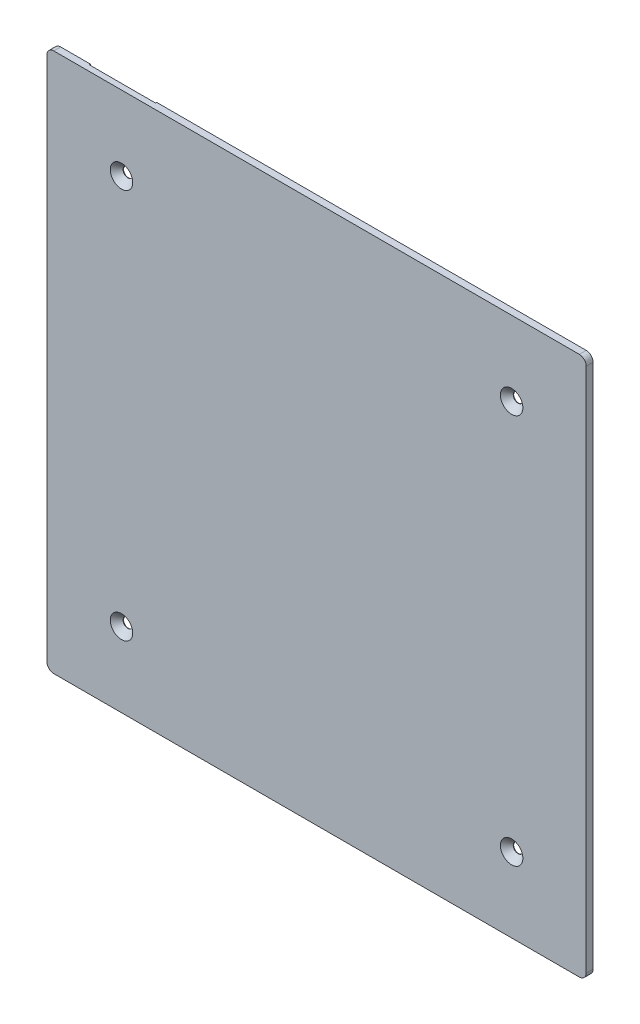
ISO-10303-21;
HEADER;
FILE_DESCRIPTION(('STEP AP214'),'2;1');
FILE_NAME('part.step','',(''),(''),'','','');
FILE_SCHEMA(('AUTOMOTIVE_DESIGN { 1 0 10303 214 1 1 1 1 }'));
ENDSEC;
DATA;
#1=APPLICATION_CONTEXT('core data for automotive mechanical design processes');
#2=APPLICATION_PROTOCOL_DEFINITION('international standard','automotive_design',2000,#1);
#3=PRODUCT_CONTEXT('',#1,'mechanical');
#4=PRODUCT('Part','Part','',(#3));
#5=PRODUCT_RELATED_PRODUCT_CATEGORY('part','',(#4));
#6=PRODUCT_DEFINITION_FORMATION('','',#4);
#7=PRODUCT_DEFINITION_CONTEXT('part definition',#1,'design');
#8=PRODUCT_DEFINITION('design','',#6,#7);
#9=PRODUCT_DEFINITION_SHAPE('','',#8);
#10=(LENGTH_UNIT() NAMED_UNIT(*) SI_UNIT(.MILLI.,.METRE.));
#11=(NAMED_UNIT(*) PLANE_ANGLE_UNIT() SI_UNIT($,.RADIAN.));
#12=(NAMED_UNIT(*) SI_UNIT($,.STERADIAN.) SOLID_ANGLE_UNIT());
#13=UNCERTAINTY_MEASURE_WITH_UNIT(LENGTH_MEASURE(1.E-05),#10,'distance_accuracy_value','');
#14=(GEOMETRIC_REPRESENTATION_CONTEXT(3) GLOBAL_UNCERTAINTY_ASSIGNED_CONTEXT((#13)) GLOBAL_UNIT_ASSIGNED_CONTEXT((#10,
#11,#12)) REPRESENTATION_CONTEXT('',''));
#15=CARTESIAN_POINT('',(0.,0.,0.));
#16=DIRECTION('',(0.,0.,1.));
#17=DIRECTION('',(1.,0.,0.));
#18=AXIS2_PLACEMENT_3D('',#15,#16,#17);
#19=CARTESIAN_POINT('',(-72.6507614869108,117.5,0.5));
#20=DIRECTION('',(1.,0.,0.));
#21=DIRECTION('',(0.,0.,-1.));
#22=AXIS2_PLACEMENT_3D('',#19,#20,#21);
#23=PLANE('',#22);
#24=DIRECTION('',(0.,0.,-1.));
#25=VECTOR('',#24,1.);
#26=CARTESIAN_POINT('',(-72.6507614869108,106.050790199477,0.5));
#27=LINE('',#26,#25);
#28=CARTESIAN_POINT('',(-72.6507614869108,106.050790199477,0.));
#29=VERTEX_POINT('',#28);
#30=CARTESIAN_POINT('',(-72.6507614869108,106.050790199477,0.5));
#31=VERTEX_POINT('',#30);
#32=EDGE_CURVE('E171',#29,#31,#27,.F.);
#33=ORIENTED_EDGE('',*,*,#32,.T.);
#34=DIRECTION('',(0.,1.,0.));
#35=VECTOR('',#34,1.);
#36=CARTESIAN_POINT('',(-72.6507614869108,0.,0.5));
#37=LINE('',#36,#35);
#38=CARTESIAN_POINT('',(-72.6507614869108,117.5,0.5));
#39=VERTEX_POINT('',#38);
#40=EDGE_CURVE('E118',#39,#31,#37,.F.);
#41=ORIENTED_EDGE('',*,*,#40,.F.);
#42=DIRECTION('',(0.,0.,-1.));
#43=VECTOR('',#42,1.);
#44=CARTESIAN_POINT('',(-72.6507614869108,117.5,0.5));
#45=LINE('',#44,#43);
#46=CARTESIAN_POINT('',(-72.6507614869108,117.5,0.));
#47=VERTEX_POINT('',#46);
#48=EDGE_CURVE('E114',#47,#39,#45,.F.);
#49=ORIENTED_EDGE('',*,*,#48,.F.);
#50=DIRECTION('',(0.,1.,0.));
#51=VECTOR('',#50,1.);
#52=CARTESIAN_POINT('',(-72.6507614869108,0.,0.));
#53=LINE('',#52,#51);
#54=EDGE_CURVE('E117',#29,#47,#53,.T.);
#55=ORIENTED_EDGE('',*,*,#54,.F.);
#56=EDGE_LOOP('',(#33,#41,#49,#55));
#57=FACE_BOUND('',#56,.T.);
#58=ADVANCED_FACE('F18',(#57),#23,.F.);
#59=CARTESIAN_POINT('',(-101.46292574176,117.5,0.5));
#60=DIRECTION('',(-1.,0.,0.));
#61=DIRECTION('',(0.,0.,1.));
#62=AXIS2_PLACEMENT_3D('',#59,#60,#61);
#63=PLANE('',#62);
#64=DIRECTION('',(0.,0.,1.));
#65=VECTOR('',#64,1.);
#66=CARTESIAN_POINT('',(-101.46292574176,117.5,0.5));
#67=LINE('',#66,#65);
#68=CARTESIAN_POINT('',(-101.46292574176,117.5,0.5));
#69=VERTEX_POINT('',#68);
#70=CARTESIAN_POINT('',(-101.46292574176,117.5,0.));
#71=VERTEX_POINT('',#70);
#72=EDGE_CURVE('E123',#69,#71,#67,.F.);
#73=ORIENTED_EDGE('',*,*,#72,.F.);
#74=DIRECTION('',(0.,1.,0.));
#75=VECTOR('',#74,1.);
#76=CARTESIAN_POINT('',(-101.46292574176,0.,0.5));
#77=LINE('',#76,#75);
#78=CARTESIAN_POINT('',(-101.46292574176,106.050790199477,0.5));
#79=VERTEX_POINT('',#78);
#80=EDGE_CURVE('E131',#79,#69,#77,.T.);
#81=ORIENTED_EDGE('',*,*,#80,.F.);
#82=DIRECTION('',(0.,0.,-1.));
#83=VECTOR('',#82,1.);
#84=CARTESIAN_POINT('',(-101.46292574176,106.050790199477,0.5));
#85=LINE('',#84,#83);
#86=CARTESIAN_POINT('',(-101.46292574176,106.050790199477,0.));
#87=VERTEX_POINT('',#86);
#88=EDGE_CURVE('E174',#79,#87,#85,.T.);
#89=ORIENTED_EDGE('',*,*,#88,.T.);
#90=DIRECTION('',(0.,1.,0.));
#91=VECTOR('',#90,1.);
#92=CARTESIAN_POINT('',(-101.46292574176,0.,0.));
#93=LINE('',#92,#91);
#94=EDGE_CURVE('E95',#71,#87,#93,.F.);
#95=ORIENTED_EDGE('',*,*,#94,.F.);
#96=EDGE_LOOP('',(#73,#81,#89,#95));
#97=FACE_BOUND('',#96,.T.);
#98=ADVANCED_FACE('F338',(#97),#63,.F.);
#99=CARTESIAN_POINT('',(-72.6507614869108,106.050790199477,0.5));
#100=DIRECTION('',(0.,-1.,0.));
#101=DIRECTION('',(0.,0.,-1.));
#102=AXIS2_PLACEMENT_3D('',#99,#100,#101);
#103=PLANE('',#102);
#104=ORIENTED_EDGE('',*,*,#88,.F.);
#105=DIRECTION('',(-1.,0.,0.));
#106=VECTOR('',#105,1.);
#107=CARTESIAN_POINT('',(0.,106.050790199477,0.5));
#108=LINE('',#107,#106);
#109=EDGE_CURVE('E186',#31,#79,#108,.T.);
#110=ORIENTED_EDGE('',*,*,#109,.F.);
#111=ORIENTED_EDGE('',*,*,#32,.F.);
#112=DIRECTION('',(-1.,0.,0.));
#113=VECTOR('',#112,1.);
#114=CARTESIAN_POINT('',(0.,106.050790199477,0.));
#115=LINE('',#114,#113);
#116=EDGE_CURVE('E130',#87,#29,#115,.F.);
#117=ORIENTED_EDGE('',*,*,#116,.F.);
#118=EDGE_LOOP('',(#104,#110,#111,#117));
#119=FACE_BOUND('',#118,.T.);
#120=ADVANCED_FACE('F251',(#119),#103,.F.);
#121=CARTESIAN_POINT('',(-85.,-85.,3.));
#122=DIRECTION('',(0.,0.,-1.));
#123=DIRECTION('',(-1.,0.,0.));
#124=AXIS2_PLACEMENT_3D('',#121,#122,#123);
#125=CYLINDRICAL_SURFACE('',#124,2.1);
#126=CARTESIAN_POINT('',(-85.,-85.,0.));
#127=DIRECTION('',(0.,0.,-1.));
#128=DIRECTION('',(-1.,0.,0.));
#129=AXIS2_PLACEMENT_3D('',#126,#127,#128);
#130=CIRCLE('',#129,2.1);
#131=CARTESIAN_POINT('',(-87.1,-85.,0.));
#132=VERTEX_POINT('',#131);
#133=EDGE_CURVE('E21',#132,#132,#130,.F.);
#134=ORIENTED_EDGE('',*,*,#133,.F.);
#135=EDGE_LOOP('',(#134));
#136=FACE_BOUND('',#135,.T.);
#137=CARTESIAN_POINT('',(-85.,-85.,0.200000000006639));
#138=DIRECTION('',(0.,0.,1.));
#139=DIRECTION('',(1.,0.,0.));
#140=AXIS2_PLACEMENT_3D('',#137,#138,#139);
#141=CIRCLE('',#140,2.09999999994806);
#142=CARTESIAN_POINT('',(-82.9000000000519,-85.,0.200000000006639));
#143=VERTEX_POINT('',#142);
#144=EDGE_CURVE('E166',#143,#143,#141,.T.);
#145=ORIENTED_EDGE('',*,*,#144,.T.);
#146=EDGE_LOOP('',(#145));
#147=FACE_BOUND('',#146,.T.);
#148=ADVANCED_FACE('F247',(#136,#147),#125,.F.);
#149=CARTESIAN_POINT('',(85.,-85.,3.));
#150=DIRECTION('',(0.,0.,-1.));
#151=DIRECTION('',(-1.,0.,0.));
#152=AXIS2_PLACEMENT_3D('',#149,#150,#151);
#153=CYLINDRICAL_SURFACE('',#152,2.1);
#154=CARTESIAN_POINT('',(85.,-85.,0.));
#155=DIRECTION('',(0.,0.,-1.));
#156=DIRECTION('',(-1.,0.,0.));
#157=AXIS2_PLACEMENT_3D('',#154,#155,#156);
#158=CIRCLE('',#157,2.1);
#159=CARTESIAN_POINT('',(82.9,-85.,0.));
#160=VERTEX_POINT('',#159);
#161=EDGE_CURVE('E169',#160,#160,#158,.F.);
#162=ORIENTED_EDGE('',*,*,#161,.F.);
#163=EDGE_LOOP('',(#162));
#164=FACE_BOUND('',#163,.T.);
#165=CARTESIAN_POINT('',(85.,-85.,0.200000000006639));
#166=DIRECTION('',(0.,0.,1.));
#167=DIRECTION('',(1.,0.,0.));
#168=AXIS2_PLACEMENT_3D('',#165,#166,#167);
#169=CIRCLE('',#168,2.09999999996396);
#170=CARTESIAN_POINT('',(87.099999999964,-85.,0.200000000006639));
#171=VERTEX_POINT('',#170);
#172=EDGE_CURVE('E163',#171,#171,#169,.T.);
#173=ORIENTED_EDGE('',*,*,#172,.T.);
#174=EDGE_LOOP('',(#173));
#175=FACE_BOUND('',#174,.T.);
#176=ADVANCED_FACE('F250',(#164,#175),#153,.F.);
#177=CARTESIAN_POINT('',(85.,85.,3.));
#178=DIRECTION('',(0.,0.,-1.));
#179=DIRECTION('',(-1.,0.,0.));
#180=AXIS2_PLACEMENT_3D('',#177,#178,#179);
#181=CYLINDRICAL_SURFACE('',#180,2.1);
#182=CARTESIAN_POINT('',(85.,85.,0.));
#183=DIRECTION('',(0.,0.,-1.));
#184=DIRECTION('',(-1.,0.,0.));
#185=AXIS2_PLACEMENT_3D('',#182,#183,#184);
#186=CIRCLE('',#185,2.1);
#187=CARTESIAN_POINT('',(82.9,85.,0.));
#188=VERTEX_POINT('',#187);
#189=EDGE_CURVE('E237',#188,#188,#186,.F.);
#190=ORIENTED_EDGE('',*,*,#189,.F.);
#191=EDGE_LOOP('',(#190));
#192=FACE_BOUND('',#191,.T.);
#193=CARTESIAN_POINT('',(85.,85.,0.200000000006639));
#194=DIRECTION('',(0.,0.,1.));
#195=DIRECTION('',(1.,0.,0.));
#196=AXIS2_PLACEMENT_3D('',#193,#194,#195);
#197=CIRCLE('',#196,2.09999999996396);
#198=CARTESIAN_POINT('',(87.099999999964,85.,0.200000000006639));
#199=VERTEX_POINT('',#198);
#200=EDGE_CURVE('E160',#199,#199,#197,.T.);
#201=ORIENTED_EDGE('',*,*,#200,.T.);
#202=EDGE_LOOP('',(#201));
#203=FACE_BOUND('',#202,.T.);
#204=ADVANCED_FACE('F321',(#192,#203),#181,.F.);
#205=CARTESIAN_POINT('',(-85.,85.,3.));
#206=DIRECTION('',(0.,0.,-1.));
#207=DIRECTION('',(-1.,0.,0.));
#208=AXIS2_PLACEMENT_3D('',#205,#206,#207);
#209=CYLINDRICAL_SURFACE('',#208,2.1);
#210=CARTESIAN_POINT('',(-85.,85.,0.));
#211=DIRECTION('',(0.,0.,-1.));
#212=DIRECTION('',(-1.,0.,0.));
#213=AXIS2_PLACEMENT_3D('',#210,#211,#212);
#214=CIRCLE('',#213,2.1);
#215=CARTESIAN_POINT('',(-87.1,85.,0.));
#216=VERTEX_POINT('',#215);
#217=EDGE_CURVE('E239',#216,#216,#214,.F.);
#218=ORIENTED_EDGE('',*,*,#217,.F.);
#219=EDGE_LOOP('',(#218));
#220=FACE_BOUND('',#219,.T.);
#221=CARTESIAN_POINT('',(-85.,85.,0.200000000006639));
#222=DIRECTION('',(0.,0.,1.));
#223=DIRECTION('',(1.,0.,0.));
#224=AXIS2_PLACEMENT_3D('',#221,#222,#223);
#225=CIRCLE('',#224,2.09999999994806);
#226=CARTESIAN_POINT('',(-82.9000000000519,85.,0.200000000006639));
#227=VERTEX_POINT('',#226);
#228=EDGE_CURVE('E157',#227,#227,#225,.T.);
#229=ORIENTED_EDGE('',*,*,#228,.T.);
#230=EDGE_LOOP('',(#229));
#231=FACE_BOUND('',#230,.T.);
#232=ADVANCED_FACE('F323',(#220,#231),#209,.F.);
#233=CARTESIAN_POINT('',(0.,0.,0.5));
#234=DIRECTION('',(0.,0.,-1.));
#235=DIRECTION('',(-1.,0.,0.));
#236=AXIS2_PLACEMENT_3D('',#233,#234,#235);
#237=PLANE('',#236);
#238=ORIENTED_EDGE('',*,*,#80,.T.);
#239=DIRECTION('',(1.,0.,0.));
#240=VECTOR('',#239,1.);
#241=CARTESIAN_POINT('',(-117.5,117.5,0.5));
#242=LINE('',#241,#240);
#243=EDGE_CURVE('E137',#69,#39,#242,.T.);
#244=ORIENTED_EDGE('',*,*,#243,.T.);
#245=ORIENTED_EDGE('',*,*,#40,.T.);
#246=ORIENTED_EDGE('',*,*,#109,.T.);
#247=EDGE_LOOP('',(#238,#244,#245,#246));
#248=FACE_BOUND('',#247,.T.);
#249=ADVANCED_FACE('F268',(#248),#237,.T.);
#250=CARTESIAN_POINT('',(0.,0.,0.));
#251=DIRECTION('',(0.,0.,-1.));
#252=DIRECTION('',(-1.,0.,0.));
#253=AXIS2_PLACEMENT_3D('',#250,#251,#252);
#254=PLANE('',#253);
#255=ORIENTED_EDGE('',*,*,#161,.T.);
#256=EDGE_LOOP('',(#255));
#257=FACE_BOUND('',#256,.T.);
#258=ORIENTED_EDGE('',*,*,#189,.T.);
#259=EDGE_LOOP('',(#258));
#260=FACE_BOUND('',#259,.T.);
#261=ORIENTED_EDGE('',*,*,#217,.T.);
#262=EDGE_LOOP('',(#261));
#263=FACE_BOUND('',#262,.T.);
#264=ORIENTED_EDGE('',*,*,#133,.T.);
#265=EDGE_LOOP('',(#264));
#266=FACE_BOUND('',#265,.T.);
#267=ORIENTED_EDGE('',*,*,#94,.T.);
#268=ORIENTED_EDGE('',*,*,#116,.T.);
#269=ORIENTED_EDGE('',*,*,#54,.T.);
#270=DIRECTION('',(1.,0.,0.));
#271=VECTOR('',#270,1.);
#272=CARTESIAN_POINT('',(-117.5,117.5,0.));
#273=LINE('',#272,#271);
#274=CARTESIAN_POINT('',(114.5,117.5,0.));
#275=VERTEX_POINT('',#274);
#276=EDGE_CURVE('E127',#47,#275,#273,.T.);
#277=ORIENTED_EDGE('',*,*,#276,.T.);
#278=CARTESIAN_POINT('',(114.5,114.5,0.));
#279=DIRECTION('',(0.,0.,-1.));
#280=DIRECTION('',(-1.,0.,0.));
#281=AXIS2_PLACEMENT_3D('',#278,#279,#280);
#282=CIRCLE('',#281,3.);
#283=CARTESIAN_POINT('',(117.5,114.5,0.));
#284=VERTEX_POINT('',#283);
#285=EDGE_CURVE('E136',#284,#275,#282,.F.);
#286=ORIENTED_EDGE('',*,*,#285,.F.);
#287=DIRECTION('',(0.,1.,0.));
#288=VECTOR('',#287,1.);
#289=CARTESIAN_POINT('',(117.5,-117.5,0.));
#290=LINE('',#289,#288);
#291=CARTESIAN_POINT('',(117.5,-114.5,0.));
#292=VERTEX_POINT('',#291);
#293=EDGE_CURVE('E144',#284,#292,#290,.F.);
#294=ORIENTED_EDGE('',*,*,#293,.T.);
#295=CARTESIAN_POINT('',(114.5,-114.5,0.));
#296=DIRECTION('',(0.,0.,-1.));
#297=DIRECTION('',(-1.,0.,0.));
#298=AXIS2_PLACEMENT_3D('',#295,#296,#297);
#299=CIRCLE('',#298,3.);
#300=CARTESIAN_POINT('',(114.5,-117.5,0.));
#301=VERTEX_POINT('',#300);
#302=EDGE_CURVE('E231',#301,#292,#299,.F.);
#303=ORIENTED_EDGE('',*,*,#302,.F.);
#304=DIRECTION('',(1.,0.,0.));
#305=VECTOR('',#304,1.);
#306=CARTESIAN_POINT('',(-117.5,-117.5,0.));
#307=LINE('',#306,#305);
#308=CARTESIAN_POINT('',(-114.5,-117.5,0.));
#309=VERTEX_POINT('',#308);
#310=EDGE_CURVE('E230',#301,#309,#307,.F.);
#311=ORIENTED_EDGE('',*,*,#310,.T.);
#312=CARTESIAN_POINT('',(-114.5,-114.5,0.));
#313=DIRECTION('',(0.,0.,-1.));
#314=DIRECTION('',(-1.,0.,0.));
#315=AXIS2_PLACEMENT_3D('',#312,#313,#314);
#316=CIRCLE('',#315,3.);
#317=CARTESIAN_POINT('',(-117.5,-114.5,0.));
#318=VERTEX_POINT('',#317);
#319=EDGE_CURVE('E227',#318,#309,#316,.F.);
#320=ORIENTED_EDGE('',*,*,#319,.F.);
#321=DIRECTION('',(0.,1.,0.));
#322=VECTOR('',#321,1.);
#323=CARTESIAN_POINT('',(-117.5,-117.5,0.));
#324=LINE('',#323,#322);
#325=CARTESIAN_POINT('',(-117.5,114.5,0.));
#326=VERTEX_POINT('',#325);
#327=EDGE_CURVE('E226',#318,#326,#324,.T.);
#328=ORIENTED_EDGE('',*,*,#327,.T.);
#329=CARTESIAN_POINT('',(-114.5,114.5,0.));
#330=DIRECTION('',(0.,0.,-1.));
#331=DIRECTION('',(-1.,0.,0.));
#332=AXIS2_PLACEMENT_3D('',#329,#330,#331);
#333=CIRCLE('',#332,3.);
#334=CARTESIAN_POINT('',(-114.5,117.5,0.));
#335=VERTEX_POINT('',#334);
#336=EDGE_CURVE('E85',#335,#326,#333,.F.);
#337=ORIENTED_EDGE('',*,*,#336,.F.);
#338=DIRECTION('',(1.,0.,0.));
#339=VECTOR('',#338,1.);
#340=CARTESIAN_POINT('',(-117.5,117.5,0.));
#341=LINE('',#340,#339);
#342=EDGE_CURVE('E140',#335,#71,#341,.T.);
#343=ORIENTED_EDGE('',*,*,#342,.T.);
#344=EDGE_LOOP('',(#267,#268,#269,#277,#286,#294,#303,#311,#320,#328,#337,#343));
#345=FACE_BOUND('',#344,.T.);
#346=ADVANCED_FACE('F126',(#257,#260,#263,#266,#345),#254,.T.);
#347=CARTESIAN_POINT('',(-85.,-85.,2.9999999999859));
#348=DIRECTION('',(0.,0.,1.));
#349=DIRECTION('',(1.,0.,0.));
#350=AXIS2_PLACEMENT_3D('',#347,#348,#349);
#351=CONICAL_SURFACE('',#350,4.89999999998417,0.785398163407599);
#352=CARTESIAN_POINT('',(-85.,-85.,3.00000000002229));
#353=DIRECTION('',(0.,0.,1.));
#354=DIRECTION('',(1.,0.,0.));
#355=AXIS2_PLACEMENT_3D('',#352,#353,#354);
#356=CIRCLE('',#355,4.90000000002055);
#357=CARTESIAN_POINT('',(-80.0999999999794,-85.,3.00000000002229));
#358=VERTEX_POINT('',#357);
#359=EDGE_CURVE('E223',#358,#358,#356,.T.);
#360=ORIENTED_EDGE('',*,*,#359,.T.);
#361=EDGE_LOOP('',(#360));
#362=FACE_BOUND('',#361,.T.);
#363=ORIENTED_EDGE('',*,*,#144,.F.);
#364=EDGE_LOOP('',(#363));
#365=FACE_BOUND('',#364,.T.);
#366=ADVANCED_FACE('F255',(#362,#365),#351,.F.);
#367=CARTESIAN_POINT('',(85.,-85.,2.99999999987222));
#368=DIRECTION('',(0.,0.,1.));
#369=DIRECTION('',(0.,-1.,0.));
#370=AXIS2_PLACEMENT_3D('',#367,#368,#369);
#371=CONICAL_SURFACE('',#370,4.89999999988638,0.785398163397448);
#372=CARTESIAN_POINT('',(85.,-85.,2.9999999999859));
#373=DIRECTION('',(0.,0.,1.));
#374=DIRECTION('',(0.,-1.,0.));
#375=AXIS2_PLACEMENT_3D('',#372,#373,#374);
#376=CIRCLE('',#375,4.90000000000007);
#377=CARTESIAN_POINT('',(85.,-89.9000000000001,2.9999999999859));
#378=VERTEX_POINT('',#377);
#379=EDGE_CURVE('E220',#378,#378,#376,.T.);
#380=ORIENTED_EDGE('',*,*,#379,.T.);
#381=EDGE_LOOP('',(#380));
#382=FACE_BOUND('',#381,.T.);
#383=ORIENTED_EDGE('',*,*,#172,.F.);
#384=EDGE_LOOP('',(#383));
#385=FACE_BOUND('',#384,.T.);
#386=ADVANCED_FACE('F257',(#382,#385),#371,.F.);
#387=CARTESIAN_POINT('',(85.,85.,2.99999999987222));
#388=DIRECTION('',(0.,0.,1.));
#389=DIRECTION('',(0.,-1.,0.));
#390=AXIS2_PLACEMENT_3D('',#387,#388,#389);
#391=CONICAL_SURFACE('',#390,4.89999999988638,0.785398163397448);
#392=CARTESIAN_POINT('',(85.,85.,2.9999999999859));
#393=DIRECTION('',(0.,0.,1.));
#394=DIRECTION('',(0.,-1.,0.));
#395=AXIS2_PLACEMENT_3D('',#392,#393,#394);
#396=CIRCLE('',#395,4.90000000000007);
#397=CARTESIAN_POINT('',(85.,80.1,2.9999999999859));
#398=VERTEX_POINT('',#397);
#399=EDGE_CURVE('E217',#398,#398,#396,.T.);
#400=ORIENTED_EDGE('',*,*,#399,.T.);
#401=EDGE_LOOP('',(#400));
#402=FACE_BOUND('',#401,.T.);
#403=ORIENTED_EDGE('',*,*,#200,.F.);
#404=EDGE_LOOP('',(#403));
#405=FACE_BOUND('',#404,.T.);
#406=ADVANCED_FACE('F265',(#402,#405),#391,.F.);
#407=CARTESIAN_POINT('',(-85.,85.,2.9999999999859));
#408=DIRECTION('',(0.,0.,1.));
#409=DIRECTION('',(1.,0.,0.));
#410=AXIS2_PLACEMENT_3D('',#407,#408,#409);
#411=CONICAL_SURFACE('',#410,4.89999999998417,0.785398163407599);
#412=CARTESIAN_POINT('',(-85.,85.,3.00000000002229));
#413=DIRECTION('',(0.,0.,1.));
#414=DIRECTION('',(1.,0.,0.));
#415=AXIS2_PLACEMENT_3D('',#412,#413,#414);
#416=CIRCLE('',#415,4.90000000002055);
#417=CARTESIAN_POINT('',(-80.0999999999794,85.,3.00000000002229));
#418=VERTEX_POINT('',#417);
#419=EDGE_CURVE('E214',#418,#418,#416,.T.);
#420=ORIENTED_EDGE('',*,*,#419,.T.);
#421=EDGE_LOOP('',(#420));
#422=FACE_BOUND('',#421,.T.);
#423=ORIENTED_EDGE('',*,*,#228,.F.);
#424=EDGE_LOOP('',(#423));
#425=FACE_BOUND('',#424,.T.);
#426=ADVANCED_FACE('F308',(#422,#425),#411,.F.);
#427=CARTESIAN_POINT('',(-114.5,114.5,3.));
#428=DIRECTION('',(0.,0.,-1.));
#429=DIRECTION('',(-1.,0.,0.));
#430=AXIS2_PLACEMENT_3D('',#427,#428,#429);
#431=CYLINDRICAL_SURFACE('',#430,3.);
#432=ORIENTED_EDGE('',*,*,#336,.T.);
#433=DIRECTION('',(0.,0.,-1.));
#434=VECTOR('',#433,1.);
#435=CARTESIAN_POINT('',(-117.5,114.5,3.));
#436=LINE('',#435,#434);
#437=CARTESIAN_POINT('',(-117.5,114.5,3.));
#438=VERTEX_POINT('',#437);
#439=EDGE_CURVE('E509',#326,#438,#436,.F.);
#440=ORIENTED_EDGE('',*,*,#439,.T.);
#441=CARTESIAN_POINT('',(-114.5,114.5,3.));
#442=DIRECTION('',(0.,0.,-1.));
#443=DIRECTION('',(-1.,0.,0.));
#444=AXIS2_PLACEMENT_3D('',#441,#442,#443);
#445=CIRCLE('',#444,3.);
#446=CARTESIAN_POINT('',(-114.5,117.5,3.));
#447=VERTEX_POINT('',#446);
#448=EDGE_CURVE('E211',#438,#447,#445,.T.);
#449=ORIENTED_EDGE('',*,*,#448,.T.);
#450=DIRECTION('',(0.,0.,-1.));
#451=VECTOR('',#450,1.);
#452=CARTESIAN_POINT('',(-114.5,117.5,3.));
#453=LINE('',#452,#451);
#454=EDGE_CURVE('E151',#447,#335,#453,.T.);
#455=ORIENTED_EDGE('',*,*,#454,.T.);
#456=EDGE_LOOP('',(#432,#440,#449,#455));
#457=FACE_BOUND('',#456,.T.);
#458=ADVANCED_FACE('F305',(#457),#431,.T.);
#459=CARTESIAN_POINT('',(-117.5,117.5,3.));
#460=DIRECTION('',(0.,-1.,0.));
#461=DIRECTION('',(0.,0.,-1.));
#462=AXIS2_PLACEMENT_3D('',#459,#460,#461);
#463=PLANE('',#462);
#464=ORIENTED_EDGE('',*,*,#48,.T.);
#465=ORIENTED_EDGE('',*,*,#243,.F.);
#466=ORIENTED_EDGE('',*,*,#72,.T.);
#467=ORIENTED_EDGE('',*,*,#342,.F.);
#468=ORIENTED_EDGE('',*,*,#454,.F.);
#469=DIRECTION('',(-1.,0.,0.));
#470=VECTOR('',#469,1.);
#471=CARTESIAN_POINT('',(0.,117.5,3.));
#472=LINE('',#471,#470);
#473=CARTESIAN_POINT('',(114.5,117.5,3.));
#474=VERTEX_POINT('',#473);
#475=EDGE_CURVE('E210',#447,#474,#472,.F.);
#476=ORIENTED_EDGE('',*,*,#475,.T.);
#477=DIRECTION('',(0.,0.,-1.));
#478=VECTOR('',#477,1.);
#479=CARTESIAN_POINT('',(114.5,117.5,3.));
#480=LINE('',#479,#478);
#481=EDGE_CURVE('E135',#275,#474,#480,.F.);
#482=ORIENTED_EDGE('',*,*,#481,.F.);
#483=ORIENTED_EDGE('',*,*,#276,.F.);
#484=EDGE_LOOP('',(#464,#465,#466,#467,#468,#476,#482,#483));
#485=FACE_BOUND('',#484,.T.);
#486=ADVANCED_FACE('F133',(#485),#463,.F.);
#487=CARTESIAN_POINT('',(114.5,114.5,3.));
#488=DIRECTION('',(0.,0.,-1.));
#489=DIRECTION('',(-1.,0.,0.));
#490=AXIS2_PLACEMENT_3D('',#487,#488,#489);
#491=CYLINDRICAL_SURFACE('',#490,3.);
#492=ORIENTED_EDGE('',*,*,#285,.T.);
#493=ORIENTED_EDGE('',*,*,#481,.T.);
#494=CARTESIAN_POINT('',(114.5,114.5,3.));
#495=DIRECTION('',(0.,0.,-1.));
#496=DIRECTION('',(-1.,0.,0.));
#497=AXIS2_PLACEMENT_3D('',#494,#495,#496);
#498=CIRCLE('',#497,3.);
#499=CARTESIAN_POINT('',(117.5,114.5,3.));
#500=VERTEX_POINT('',#499);
#501=EDGE_CURVE('E207',#474,#500,#498,.T.);
#502=ORIENTED_EDGE('',*,*,#501,.T.);
#503=DIRECTION('',(0.,0.,1.));
#504=VECTOR('',#503,1.);
#505=CARTESIAN_POINT('',(117.5,114.5,3.));
#506=LINE('',#505,#504);
#507=EDGE_CURVE('E498',#500,#284,#506,.F.);
#508=ORIENTED_EDGE('',*,*,#507,.T.);
#509=EDGE_LOOP('',(#492,#493,#502,#508));
#510=FACE_BOUND('',#509,.T.);
#511=ADVANCED_FACE('F298',(#510),#491,.T.);
#512=CARTESIAN_POINT('',(117.5,-117.5,3.));
#513=DIRECTION('',(-1.,0.,0.));
#514=DIRECTION('',(0.,0.,1.));
#515=AXIS2_PLACEMENT_3D('',#512,#513,#514);
#516=PLANE('',#515);
#517=DIRECTION('',(0.,0.,-1.));
#518=VECTOR('',#517,1.);
#519=CARTESIAN_POINT('',(117.5,-114.5,3.));
#520=LINE('',#519,#518);
#521=CARTESIAN_POINT('',(117.5,-114.5,3.));
#522=VERTEX_POINT('',#521);
#523=EDGE_CURVE('E232',#292,#522,#520,.F.);
#524=ORIENTED_EDGE('',*,*,#523,.F.);
#525=ORIENTED_EDGE('',*,*,#293,.F.);
#526=ORIENTED_EDGE('',*,*,#507,.F.);
#527=DIRECTION('',(0.,1.,0.));
#528=VECTOR('',#527,1.);
#529=CARTESIAN_POINT('',(117.5,0.,3.));
#530=LINE('',#529,#528);
#531=EDGE_CURVE('E206',#500,#522,#530,.F.);
#532=ORIENTED_EDGE('',*,*,#531,.T.);
#533=EDGE_LOOP('',(#524,#525,#526,#532));
#534=FACE_BOUND('',#533,.T.);
#535=ADVANCED_FACE('F294',(#534),#516,.F.);
#536=CARTESIAN_POINT('',(114.5,-114.5,3.));
#537=DIRECTION('',(0.,0.,-1.));
#538=DIRECTION('',(-1.,0.,0.));
#539=AXIS2_PLACEMENT_3D('',#536,#537,#538);
#540=CYLINDRICAL_SURFACE('',#539,3.);
#541=ORIENTED_EDGE('',*,*,#302,.T.);
#542=ORIENTED_EDGE('',*,*,#523,.T.);
#543=CARTESIAN_POINT('',(114.5,-114.5,3.));
#544=DIRECTION('',(0.,0.,-1.));
#545=DIRECTION('',(-1.,0.,0.));
#546=AXIS2_PLACEMENT_3D('',#543,#544,#545);
#547=CIRCLE('',#546,3.);
#548=CARTESIAN_POINT('',(114.5,-117.5,3.));
#549=VERTEX_POINT('',#548);
#550=EDGE_CURVE('E203',#522,#549,#547,.T.);
#551=ORIENTED_EDGE('',*,*,#550,.T.);
#552=DIRECTION('',(0.,0.,1.));
#553=VECTOR('',#552,1.);
#554=CARTESIAN_POINT('',(114.5,-117.5,3.));
#555=LINE('',#554,#553);
#556=EDGE_CURVE('E490',#549,#301,#555,.F.);
#557=ORIENTED_EDGE('',*,*,#556,.T.);
#558=EDGE_LOOP('',(#541,#542,#551,#557));
#559=FACE_BOUND('',#558,.T.);
#560=ADVANCED_FACE('F290',(#559),#540,.T.);
#561=CARTESIAN_POINT('',(-117.5,-117.5,3.));
#562=DIRECTION('',(0.,1.,0.));
#563=DIRECTION('',(0.,0.,1.));
#564=AXIS2_PLACEMENT_3D('',#561,#562,#563);
#565=PLANE('',#564);
#566=DIRECTION('',(0.,0.,-1.));
#567=VECTOR('',#566,1.);
#568=CARTESIAN_POINT('',(-114.5,-117.5,3.));
#569=LINE('',#568,#567);
#570=CARTESIAN_POINT('',(-114.5,-117.5,3.));
#571=VERTEX_POINT('',#570);
#572=EDGE_CURVE('E229',#309,#571,#569,.F.);
#573=ORIENTED_EDGE('',*,*,#572,.F.);
#574=ORIENTED_EDGE('',*,*,#310,.F.);
#575=ORIENTED_EDGE('',*,*,#556,.F.);
#576=DIRECTION('',(-1.,0.,0.));
#577=VECTOR('',#576,1.);
#578=CARTESIAN_POINT('',(0.,-117.5,3.));
#579=LINE('',#578,#577);
#580=EDGE_CURVE('E202',#549,#571,#579,.T.);
#581=ORIENTED_EDGE('',*,*,#580,.T.);
#582=EDGE_LOOP('',(#573,#574,#575,#581));
#583=FACE_BOUND('',#582,.T.);
#584=ADVANCED_FACE('F286',(#583),#565,.F.);
#585=CARTESIAN_POINT('',(-114.5,-114.5,3.));
#586=DIRECTION('',(0.,0.,-1.));
#587=DIRECTION('',(-1.,0.,0.));
#588=AXIS2_PLACEMENT_3D('',#585,#586,#587);
#589=CYLINDRICAL_SURFACE('',#588,3.);
#590=ORIENTED_EDGE('',*,*,#319,.T.);
#591=ORIENTED_EDGE('',*,*,#572,.T.);
#592=CARTESIAN_POINT('',(-114.5,-114.5,3.));
#593=DIRECTION('',(0.,0.,-1.));
#594=DIRECTION('',(-1.,0.,0.));
#595=AXIS2_PLACEMENT_3D('',#592,#593,#594);
#596=CIRCLE('',#595,3.);
#597=CARTESIAN_POINT('',(-117.5,-114.5,3.));
#598=VERTEX_POINT('',#597);
#599=EDGE_CURVE('E27',#571,#598,#596,.T.);
#600=ORIENTED_EDGE('',*,*,#599,.T.);
#601=DIRECTION('',(0.,0.,-1.));
#602=VECTOR('',#601,1.);
#603=CARTESIAN_POINT('',(-117.5,-114.5,3.));
#604=LINE('',#603,#602);
#605=EDGE_CURVE('E35',#598,#318,#604,.T.);
#606=ORIENTED_EDGE('',*,*,#605,.T.);
#607=EDGE_LOOP('',(#590,#591,#600,#606));
#608=FACE_BOUND('',#607,.T.);
#609=ADVANCED_FACE('F279',(#608),#589,.T.);
#610=CARTESIAN_POINT('',(-117.5,-117.5,3.));
#611=DIRECTION('',(1.,0.,0.));
#612=DIRECTION('',(0.,0.,-1.));
#613=AXIS2_PLACEMENT_3D('',#610,#611,#612);
#614=PLANE('',#613);
#615=ORIENTED_EDGE('',*,*,#605,.F.);
#616=DIRECTION('',(0.,1.,0.));
#617=VECTOR('',#616,1.);
#618=CARTESIAN_POINT('',(-117.5,0.,3.));
#619=LINE('',#618,#617);
#620=EDGE_CURVE('E11',#598,#438,#619,.T.);
#621=ORIENTED_EDGE('',*,*,#620,.T.);
#622=ORIENTED_EDGE('',*,*,#439,.F.);
#623=ORIENTED_EDGE('',*,*,#327,.F.);
#624=EDGE_LOOP('',(#615,#621,#622,#623));
#625=FACE_BOUND('',#624,.T.);
#626=ADVANCED_FACE('F273',(#625),#614,.F.);
#627=CARTESIAN_POINT('',(0.,0.,3.));
#628=DIRECTION('',(0.,0.,-1.));
#629=DIRECTION('',(-1.,0.,0.));
#630=AXIS2_PLACEMENT_3D('',#627,#628,#629);
#631=PLANE('',#630);
#632=ORIENTED_EDGE('',*,*,#599,.F.);
#633=ORIENTED_EDGE('',*,*,#580,.F.);
#634=ORIENTED_EDGE('',*,*,#550,.F.);
#635=ORIENTED_EDGE('',*,*,#531,.F.);
#636=ORIENTED_EDGE('',*,*,#501,.F.);
#637=ORIENTED_EDGE('',*,*,#475,.F.);
#638=ORIENTED_EDGE('',*,*,#448,.F.);
#639=ORIENTED_EDGE('',*,*,#620,.F.);
#640=EDGE_LOOP('',(#632,#633,#634,#635,#636,#637,#638,#639));
#641=FACE_BOUND('',#640,.T.);
#642=ORIENTED_EDGE('',*,*,#419,.F.);
#643=EDGE_LOOP('',(#642));
#644=FACE_BOUND('',#643,.T.);
#645=ORIENTED_EDGE('',*,*,#399,.F.);
#646=EDGE_LOOP('',(#645));
#647=FACE_BOUND('',#646,.T.);
#648=ORIENTED_EDGE('',*,*,#379,.F.);
#649=EDGE_LOOP('',(#648));
#650=FACE_BOUND('',#649,.T.);
#651=ORIENTED_EDGE('',*,*,#359,.F.);
#652=EDGE_LOOP('',(#651));
#653=FACE_BOUND('',#652,.T.);
#654=ADVANCED_FACE('F271',(#641,#644,#647,#650,#653),#631,.F.);
#655=CLOSED_SHELL('',(#58,#98,#120,#148,#176,#204,#232,#249,#346,#366,#386,#406,#426,#458,#486,
#511,#535,#560,#584,#609,#626,#654));
#656=MANIFOLD_SOLID_BREP('B1',#655);
#657=ADVANCED_BREP_SHAPE_REPRESENTATION('',(#18,#656),#14);
#658=SHAPE_DEFINITION_REPRESENTATION(#9,#657);
ENDSEC;
END-ISO-10303-21;
